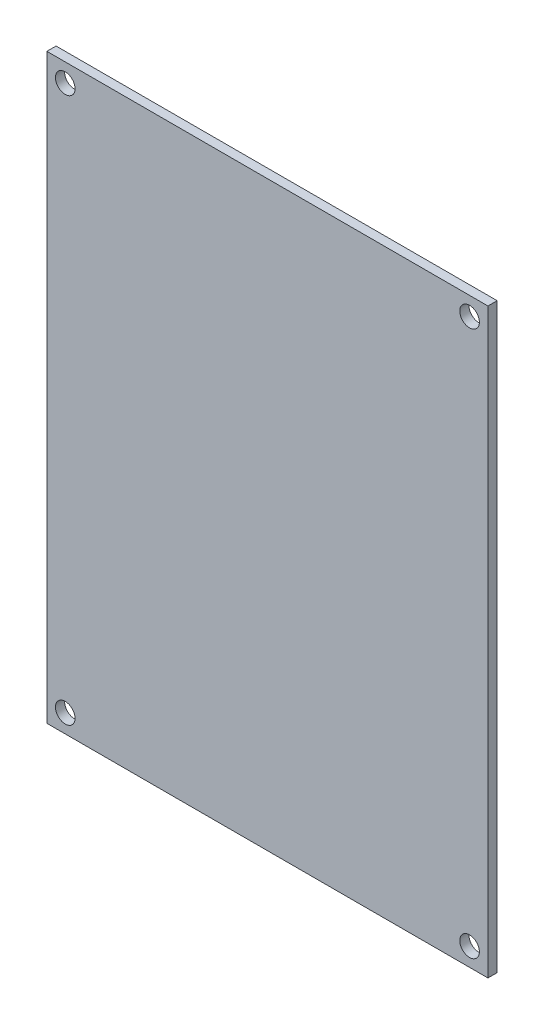
ISO-10303-21;
HEADER;
FILE_DESCRIPTION(('STEP AP214'),'2;1');
FILE_NAME('part.step','',(''),(''),'','','');
FILE_SCHEMA(('AUTOMOTIVE_DESIGN { 1 0 10303 214 1 1 1 1 }'));
ENDSEC;
DATA;
#1=APPLICATION_CONTEXT('core data for automotive mechanical design processes');
#2=APPLICATION_PROTOCOL_DEFINITION('international standard','automotive_design',2000,#1);
#3=PRODUCT_CONTEXT('',#1,'mechanical');
#4=PRODUCT('Part','Part','',(#3));
#5=PRODUCT_RELATED_PRODUCT_CATEGORY('part','',(#4));
#6=PRODUCT_DEFINITION_FORMATION('','',#4);
#7=PRODUCT_DEFINITION_CONTEXT('part definition',#1,'design');
#8=PRODUCT_DEFINITION('design','',#6,#7);
#9=PRODUCT_DEFINITION_SHAPE('','',#8);
#10=(LENGTH_UNIT() NAMED_UNIT(*) SI_UNIT(.MILLI.,.METRE.));
#11=(NAMED_UNIT(*) PLANE_ANGLE_UNIT() SI_UNIT($,.RADIAN.));
#12=(NAMED_UNIT(*) SI_UNIT($,.STERADIAN.) SOLID_ANGLE_UNIT());
#13=UNCERTAINTY_MEASURE_WITH_UNIT(LENGTH_MEASURE(1.E-05),#10,'distance_accuracy_value','');
#14=(GEOMETRIC_REPRESENTATION_CONTEXT(3) GLOBAL_UNCERTAINTY_ASSIGNED_CONTEXT((#13)) GLOBAL_UNIT_ASSIGNED_CONTEXT((#10,
#11,#12)) REPRESENTATION_CONTEXT('',''));
#15=CARTESIAN_POINT('',(0.,0.,0.));
#16=DIRECTION('',(0.,0.,1.));
#17=DIRECTION('',(1.,0.,0.));
#18=AXIS2_PLACEMENT_3D('',#15,#16,#17);
#19=CARTESIAN_POINT('',(0.,0.,1.5));
#20=DIRECTION('',(0.,0.,1.));
#21=DIRECTION('',(1.,0.,0.));
#22=AXIS2_PLACEMENT_3D('',#19,#20,#21);
#23=PLANE('',#22);
#24=CARTESIAN_POINT('',(-33.,-44.5,1.5));
#25=DIRECTION('',(0.,0.,1.));
#26=DIRECTION('',(1.,0.,0.));
#27=AXIS2_PLACEMENT_3D('',#24,#25,#26);
#28=CIRCLE('',#27,1.60000000000001);
#29=CARTESIAN_POINT('',(-31.4,-44.5,1.5));
#30=VERTEX_POINT('',#29);
#31=EDGE_CURVE('E131',#30,#30,#28,.T.);
#32=ORIENTED_EDGE('',*,*,#31,.F.);
#33=EDGE_LOOP('',(#32));
#34=FACE_BOUND('',#33,.T.);
#35=CARTESIAN_POINT('',(-33.,44.5,1.5));
#36=DIRECTION('',(0.,0.,1.));
#37=DIRECTION('',(1.,0.,0.));
#38=AXIS2_PLACEMENT_3D('',#35,#36,#37);
#39=CIRCLE('',#38,1.60000000000001);
#40=CARTESIAN_POINT('',(-31.4,44.5,1.5));
#41=VERTEX_POINT('',#40);
#42=EDGE_CURVE('E110',#41,#41,#39,.T.);
#43=ORIENTED_EDGE('',*,*,#42,.F.);
#44=EDGE_LOOP('',(#43));
#45=FACE_BOUND('',#44,.T.);
#46=DIRECTION('',(0.,-1.,0.));
#47=VECTOR('',#46,1.);
#48=CARTESIAN_POINT('',(-36.,-47.5,1.5));
#49=LINE('',#48,#47);
#50=CARTESIAN_POINT('',(-36.,47.5,1.5));
#51=VERTEX_POINT('',#50);
#52=CARTESIAN_POINT('',(-36.,-47.5,1.5));
#53=VERTEX_POINT('',#52);
#54=EDGE_CURVE('E95',#51,#53,#49,.T.);
#55=ORIENTED_EDGE('',*,*,#54,.T.);
#56=DIRECTION('',(1.,0.,0.));
#57=VECTOR('',#56,1.);
#58=CARTESIAN_POINT('',(36.,-47.5,1.5));
#59=LINE('',#58,#57);
#60=CARTESIAN_POINT('',(36.,-47.5,1.5));
#61=VERTEX_POINT('',#60);
#62=EDGE_CURVE('E90',#53,#61,#59,.T.);
#63=ORIENTED_EDGE('',*,*,#62,.T.);
#64=DIRECTION('',(0.,1.,0.));
#65=VECTOR('',#64,1.);
#66=CARTESIAN_POINT('',(36.,-47.5,1.5));
#67=LINE('',#66,#65);
#68=CARTESIAN_POINT('',(36.,47.5,1.5));
#69=VERTEX_POINT('',#68);
#70=EDGE_CURVE('E93',#61,#69,#67,.T.);
#71=ORIENTED_EDGE('',*,*,#70,.T.);
#72=DIRECTION('',(-1.,0.,0.));
#73=VECTOR('',#72,1.);
#74=CARTESIAN_POINT('',(36.,47.5,1.5));
#75=LINE('',#74,#73);
#76=EDGE_CURVE('E60',#69,#51,#75,.T.);
#77=ORIENTED_EDGE('',*,*,#76,.T.);
#78=EDGE_LOOP('',(#55,#63,#71,#77));
#79=FACE_BOUND('',#78,.T.);
#80=CARTESIAN_POINT('',(33.,44.5,1.5));
#81=DIRECTION('',(0.,0.,1.));
#82=DIRECTION('',(1.,0.,0.));
#83=AXIS2_PLACEMENT_3D('',#80,#81,#82);
#84=CIRCLE('',#83,1.60000000000001);
#85=CARTESIAN_POINT('',(34.6,44.5,1.5));
#86=VERTEX_POINT('',#85);
#87=EDGE_CURVE('E125',#86,#86,#84,.T.);
#88=ORIENTED_EDGE('',*,*,#87,.F.);
#89=EDGE_LOOP('',(#88));
#90=FACE_BOUND('',#89,.T.);
#91=CARTESIAN_POINT('',(33.,-44.5,1.5));
#92=DIRECTION('',(0.,0.,1.));
#93=DIRECTION('',(1.,0.,0.));
#94=AXIS2_PLACEMENT_3D('',#91,#92,#93);
#95=CIRCLE('',#94,1.6);
#96=CARTESIAN_POINT('',(34.6,-44.5,1.5));
#97=VERTEX_POINT('',#96);
#98=EDGE_CURVE('E137',#97,#97,#95,.T.);
#99=ORIENTED_EDGE('',*,*,#98,.F.);
#100=EDGE_LOOP('',(#99));
#101=FACE_BOUND('',#100,.T.);
#102=ADVANCED_FACE('F43',(#34,#45,#79,#90,#101),#23,.T.);
#103=CARTESIAN_POINT('',(0.,0.,0.));
#104=DIRECTION('',(0.,0.,1.));
#105=DIRECTION('',(1.,0.,0.));
#106=AXIS2_PLACEMENT_3D('',#103,#104,#105);
#107=PLANE('',#106);
#108=DIRECTION('',(0.,-1.,0.));
#109=VECTOR('',#108,1.);
#110=CARTESIAN_POINT('',(-36.,-47.5,0.));
#111=LINE('',#110,#109);
#112=CARTESIAN_POINT('',(-36.,47.5,0.));
#113=VERTEX_POINT('',#112);
#114=CARTESIAN_POINT('',(-36.,-47.5,0.));
#115=VERTEX_POINT('',#114);
#116=EDGE_CURVE('E107',#113,#115,#111,.T.);
#117=ORIENTED_EDGE('',*,*,#116,.F.);
#118=DIRECTION('',(-1.,0.,0.));
#119=VECTOR('',#118,1.);
#120=CARTESIAN_POINT('',(36.,47.5,0.));
#121=LINE('',#120,#119);
#122=CARTESIAN_POINT('',(36.,47.5,0.));
#123=VERTEX_POINT('',#122);
#124=EDGE_CURVE('E83',#123,#113,#121,.T.);
#125=ORIENTED_EDGE('',*,*,#124,.F.);
#126=DIRECTION('',(0.,1.,0.));
#127=VECTOR('',#126,1.);
#128=CARTESIAN_POINT('',(36.,-47.5,0.));
#129=LINE('',#128,#127);
#130=CARTESIAN_POINT('',(36.,-47.5,0.));
#131=VERTEX_POINT('',#130);
#132=EDGE_CURVE('E77',#131,#123,#129,.T.);
#133=ORIENTED_EDGE('',*,*,#132,.F.);
#134=DIRECTION('',(1.,0.,0.));
#135=VECTOR('',#134,1.);
#136=CARTESIAN_POINT('',(36.,-47.5,0.));
#137=LINE('',#136,#135);
#138=EDGE_CURVE('E99',#115,#131,#137,.T.);
#139=ORIENTED_EDGE('',*,*,#138,.F.);
#140=EDGE_LOOP('',(#117,#125,#133,#139));
#141=FACE_BOUND('',#140,.T.);
#142=CARTESIAN_POINT('',(-33.,44.5,0.));
#143=DIRECTION('',(0.,0.,1.));
#144=DIRECTION('',(1.,0.,0.));
#145=AXIS2_PLACEMENT_3D('',#142,#143,#144);
#146=CIRCLE('',#145,1.60000000000001);
#147=CARTESIAN_POINT('',(-31.4,44.5,0.));
#148=VERTEX_POINT('',#147);
#149=EDGE_CURVE('E122',#148,#148,#146,.T.);
#150=ORIENTED_EDGE('',*,*,#149,.T.);
#151=EDGE_LOOP('',(#150));
#152=FACE_BOUND('',#151,.T.);
#153=CARTESIAN_POINT('',(33.,44.5,0.));
#154=DIRECTION('',(0.,0.,1.));
#155=DIRECTION('',(1.,0.,0.));
#156=AXIS2_PLACEMENT_3D('',#153,#154,#155);
#157=CIRCLE('',#156,1.60000000000001);
#158=CARTESIAN_POINT('',(34.6,44.5,0.));
#159=VERTEX_POINT('',#158);
#160=EDGE_CURVE('E128',#159,#159,#157,.T.);
#161=ORIENTED_EDGE('',*,*,#160,.T.);
#162=EDGE_LOOP('',(#161));
#163=FACE_BOUND('',#162,.T.);
#164=CARTESIAN_POINT('',(-33.,-44.5,0.));
#165=DIRECTION('',(0.,0.,1.));
#166=DIRECTION('',(1.,0.,0.));
#167=AXIS2_PLACEMENT_3D('',#164,#165,#166);
#168=CIRCLE('',#167,1.60000000000001);
#169=CARTESIAN_POINT('',(-31.4,-44.5,0.));
#170=VERTEX_POINT('',#169);
#171=EDGE_CURVE('E134',#170,#170,#168,.T.);
#172=ORIENTED_EDGE('',*,*,#171,.T.);
#173=EDGE_LOOP('',(#172));
#174=FACE_BOUND('',#173,.T.);
#175=CARTESIAN_POINT('',(33.,-44.5,0.));
#176=DIRECTION('',(0.,0.,1.));
#177=DIRECTION('',(1.,0.,0.));
#178=AXIS2_PLACEMENT_3D('',#175,#176,#177);
#179=CIRCLE('',#178,1.6);
#180=CARTESIAN_POINT('',(34.6,-44.5,0.));
#181=VERTEX_POINT('',#180);
#182=EDGE_CURVE('E140',#181,#181,#179,.T.);
#183=ORIENTED_EDGE('',*,*,#182,.T.);
#184=EDGE_LOOP('',(#183));
#185=FACE_BOUND('',#184,.T.);
#186=ADVANCED_FACE('F118',(#141,#152,#163,#174,#185),#107,.F.);
#187=CARTESIAN_POINT('',(-36.,-47.5,1.5));
#188=DIRECTION('',(1.,0.,0.));
#189=DIRECTION('',(0.,0.,-1.));
#190=AXIS2_PLACEMENT_3D('',#187,#188,#189);
#191=PLANE('',#190);
#192=ORIENTED_EDGE('',*,*,#116,.T.);
#193=DIRECTION('',(0.,0.,-1.));
#194=VECTOR('',#193,1.);
#195=CARTESIAN_POINT('',(-36.,-47.5,1.5));
#196=LINE('',#195,#194);
#197=EDGE_CURVE('E11',#53,#115,#196,.T.);
#198=ORIENTED_EDGE('',*,*,#197,.F.);
#199=ORIENTED_EDGE('',*,*,#54,.F.);
#200=DIRECTION('',(0.,0.,-1.));
#201=VECTOR('',#200,1.);
#202=CARTESIAN_POINT('',(-36.,47.5,1.5));
#203=LINE('',#202,#201);
#204=EDGE_CURVE('E103',#51,#113,#203,.T.);
#205=ORIENTED_EDGE('',*,*,#204,.T.);
#206=EDGE_LOOP('',(#192,#198,#199,#205));
#207=FACE_BOUND('',#206,.T.);
#208=ADVANCED_FACE('F45',(#207),#191,.F.);
#209=CARTESIAN_POINT('',(36.,-47.5,1.5));
#210=DIRECTION('',(0.,1.,0.));
#211=DIRECTION('',(-1.,0.,0.));
#212=AXIS2_PLACEMENT_3D('',#209,#210,#211);
#213=PLANE('',#212);
#214=ORIENTED_EDGE('',*,*,#138,.T.);
#215=DIRECTION('',(0.,0.,-1.));
#216=VECTOR('',#215,1.);
#217=CARTESIAN_POINT('',(36.,-47.5,1.5));
#218=LINE('',#217,#216);
#219=EDGE_CURVE('E52',#61,#131,#218,.T.);
#220=ORIENTED_EDGE('',*,*,#219,.F.);
#221=ORIENTED_EDGE('',*,*,#62,.F.);
#222=ORIENTED_EDGE('',*,*,#197,.T.);
#223=EDGE_LOOP('',(#214,#220,#221,#222));
#224=FACE_BOUND('',#223,.T.);
#225=ADVANCED_FACE('F98',(#224),#213,.F.);
#226=CARTESIAN_POINT('',(36.,-47.5,1.5));
#227=DIRECTION('',(-1.,0.,0.));
#228=DIRECTION('',(0.,0.,1.));
#229=AXIS2_PLACEMENT_3D('',#226,#227,#228);
#230=PLANE('',#229);
#231=ORIENTED_EDGE('',*,*,#132,.T.);
#232=DIRECTION('',(0.,0.,-1.));
#233=VECTOR('',#232,1.);
#234=CARTESIAN_POINT('',(36.,47.5,1.5));
#235=LINE('',#234,#233);
#236=EDGE_CURVE('E100',#69,#123,#235,.T.);
#237=ORIENTED_EDGE('',*,*,#236,.F.);
#238=ORIENTED_EDGE('',*,*,#70,.F.);
#239=ORIENTED_EDGE('',*,*,#219,.T.);
#240=EDGE_LOOP('',(#231,#237,#238,#239));
#241=FACE_BOUND('',#240,.T.);
#242=ADVANCED_FACE('F101',(#241),#230,.F.);
#243=CARTESIAN_POINT('',(36.,47.5,1.5));
#244=DIRECTION('',(0.,-1.,0.));
#245=DIRECTION('',(1.,0.,0.));
#246=AXIS2_PLACEMENT_3D('',#243,#244,#245);
#247=PLANE('',#246);
#248=ORIENTED_EDGE('',*,*,#124,.T.);
#249=ORIENTED_EDGE('',*,*,#204,.F.);
#250=ORIENTED_EDGE('',*,*,#76,.F.);
#251=ORIENTED_EDGE('',*,*,#236,.T.);
#252=EDGE_LOOP('',(#248,#249,#250,#251));
#253=FACE_BOUND('',#252,.T.);
#254=ADVANCED_FACE('F115',(#253),#247,.F.);
#255=CARTESIAN_POINT('',(-33.,44.5,1.5));
#256=DIRECTION('',(0.,0.,-1.));
#257=DIRECTION('',(-1.,0.,0.));
#258=AXIS2_PLACEMENT_3D('',#255,#256,#257);
#259=CYLINDRICAL_SURFACE('',#258,1.60000000000001);
#260=ORIENTED_EDGE('',*,*,#42,.T.);
#261=EDGE_LOOP('',(#260));
#262=FACE_BOUND('',#261,.T.);
#263=ORIENTED_EDGE('',*,*,#149,.F.);
#264=EDGE_LOOP('',(#263));
#265=FACE_BOUND('',#264,.T.);
#266=ADVANCED_FACE('F160',(#262,#265),#259,.F.);
#267=CARTESIAN_POINT('',(33.,44.5,1.5));
#268=DIRECTION('',(0.,0.,-1.));
#269=DIRECTION('',(-1.,0.,0.));
#270=AXIS2_PLACEMENT_3D('',#267,#268,#269);
#271=CYLINDRICAL_SURFACE('',#270,1.60000000000001);
#272=ORIENTED_EDGE('',*,*,#87,.T.);
#273=EDGE_LOOP('',(#272));
#274=FACE_BOUND('',#273,.T.);
#275=ORIENTED_EDGE('',*,*,#160,.F.);
#276=EDGE_LOOP('',(#275));
#277=FACE_BOUND('',#276,.T.);
#278=ADVANCED_FACE('F207',(#274,#277),#271,.F.);
#279=CARTESIAN_POINT('',(-33.,-44.5,1.5));
#280=DIRECTION('',(0.,0.,-1.));
#281=DIRECTION('',(-1.,0.,0.));
#282=AXIS2_PLACEMENT_3D('',#279,#280,#281);
#283=CYLINDRICAL_SURFACE('',#282,1.60000000000001);
#284=ORIENTED_EDGE('',*,*,#31,.T.);
#285=EDGE_LOOP('',(#284));
#286=FACE_BOUND('',#285,.T.);
#287=ORIENTED_EDGE('',*,*,#171,.F.);
#288=EDGE_LOOP('',(#287));
#289=FACE_BOUND('',#288,.T.);
#290=ADVANCED_FACE('F215',(#286,#289),#283,.F.);
#291=CARTESIAN_POINT('',(33.,-44.5,1.5));
#292=DIRECTION('',(0.,0.,-1.));
#293=DIRECTION('',(-1.,0.,0.));
#294=AXIS2_PLACEMENT_3D('',#291,#292,#293);
#295=CYLINDRICAL_SURFACE('',#294,1.6);
#296=ORIENTED_EDGE('',*,*,#98,.T.);
#297=EDGE_LOOP('',(#296));
#298=FACE_BOUND('',#297,.T.);
#299=ORIENTED_EDGE('',*,*,#182,.F.);
#300=EDGE_LOOP('',(#299));
#301=FACE_BOUND('',#300,.T.);
#302=ADVANCED_FACE('F146',(#298,#301),#295,.F.);
#303=CLOSED_SHELL('',(#102,#186,#208,#225,#242,#254,#266,#278,#290,#302));
#304=MANIFOLD_SOLID_BREP('B2',#303);
#305=ADVANCED_BREP_SHAPE_REPRESENTATION('',(#18,#304),#14);
#306=SHAPE_DEFINITION_REPRESENTATION(#9,#305);
ENDSEC;
END-ISO-10303-21;
